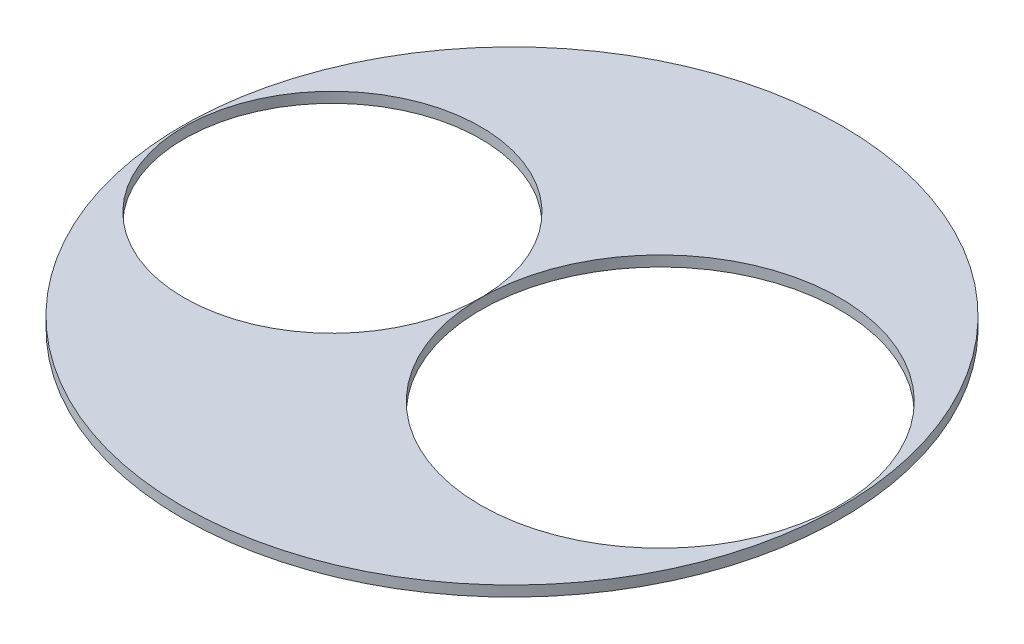
ISO-10303-21;
HEADER;
FILE_DESCRIPTION(('STEP AP214'),'2;1');
FILE_NAME('part.step','',(''),(''),'','','');
FILE_SCHEMA(('AUTOMOTIVE_DESIGN { 1 0 10303 214 1 1 1 1 }'));
ENDSEC;
DATA;
#1=APPLICATION_CONTEXT('core data for automotive mechanical design processes');
#2=APPLICATION_PROTOCOL_DEFINITION('international standard','automotive_design',2000,#1);
#3=PRODUCT_CONTEXT('',#1,'mechanical');
#4=PRODUCT('Part','Part','',(#3));
#5=PRODUCT_RELATED_PRODUCT_CATEGORY('part','',(#4));
#6=PRODUCT_DEFINITION_FORMATION('','',#4);
#7=PRODUCT_DEFINITION_CONTEXT('part definition',#1,'design');
#8=PRODUCT_DEFINITION('design','',#6,#7);
#9=PRODUCT_DEFINITION_SHAPE('','',#8);
#10=(LENGTH_UNIT() NAMED_UNIT(*) SI_UNIT(.MILLI.,.METRE.));
#11=(NAMED_UNIT(*) PLANE_ANGLE_UNIT() SI_UNIT($,.RADIAN.));
#12=(NAMED_UNIT(*) SI_UNIT($,.STERADIAN.) SOLID_ANGLE_UNIT());
#13=UNCERTAINTY_MEASURE_WITH_UNIT(LENGTH_MEASURE(1.E-05),#10,'distance_accuracy_value','');
#14=(GEOMETRIC_REPRESENTATION_CONTEXT(3) GLOBAL_UNCERTAINTY_ASSIGNED_CONTEXT((#13)) GLOBAL_UNIT_ASSIGNED_CONTEXT((#10,
#11,#12)) REPRESENTATION_CONTEXT('',''));
#15=CARTESIAN_POINT('',(0.,0.,0.));
#16=DIRECTION('',(0.,0.,1.));
#17=DIRECTION('',(1.,0.,0.));
#18=AXIS2_PLACEMENT_3D('',#15,#16,#17);
#19=CARTESIAN_POINT('',(0.,38.1,0.));
#20=DIRECTION('',(0.,1.,0.));
#21=DIRECTION('',(0.,0.,1.));
#22=AXIS2_PLACEMENT_3D('',#19,#20,#21);
#23=PLANE('',#22);
#24=CARTESIAN_POINT('',(539.876006558964,38.1,0.));
#25=DIRECTION('',(0.,1.,0.));
#26=DIRECTION('',(0.,0.,1.));
#27=AXIS2_PLACEMENT_3D('',#24,#25,#26);
#28=CIRCLE('',#27,654.05);
#29=CARTESIAN_POINT('',(539.876006558964,38.1,654.05));
#30=VERTEX_POINT('',#29);
#31=EDGE_CURVE('E48',#30,#30,#28,.T.);
#32=ORIENTED_EDGE('',*,*,#31,.F.);
#33=EDGE_LOOP('',(#32));
#34=FACE_BOUND('',#33,.T.);
#35=CARTESIAN_POINT('',(0.,38.1,0.));
#36=DIRECTION('',(0.,1.,0.));
#37=DIRECTION('',(0.,0.,1.));
#38=AXIS2_PLACEMENT_3D('',#35,#36,#37);
#39=CIRCLE('',#38,1200.);
#40=CARTESIAN_POINT('',(0.,38.1,1200.));
#41=VERTEX_POINT('',#40);
#42=EDGE_CURVE('E10',#41,#41,#39,.T.);
#43=ORIENTED_EDGE('',*,*,#42,.T.);
#44=EDGE_LOOP('',(#43));
#45=FACE_BOUND('',#44,.T.);
#46=CARTESIAN_POINT('',(-653.949393441036,38.1,0.));
#47=DIRECTION('',(0.,1.,0.));
#48=DIRECTION('',(0.,0.,1.));
#49=AXIS2_PLACEMENT_3D('',#46,#47,#48);
#50=CIRCLE('',#49,539.75);
#51=CARTESIAN_POINT('',(-653.949393441036,38.1,539.75));
#52=VERTEX_POINT('',#51);
#53=EDGE_CURVE('E53',#52,#52,#50,.T.);
#54=ORIENTED_EDGE('',*,*,#53,.F.);
#55=EDGE_LOOP('',(#54));
#56=FACE_BOUND('',#55,.T.);
#57=ADVANCED_FACE('F37',(#34,#45,#56),#23,.T.);
#58=CARTESIAN_POINT('',(0.,0.,0.));
#59=DIRECTION('',(0.,1.,0.));
#60=DIRECTION('',(0.,0.,1.));
#61=AXIS2_PLACEMENT_3D('',#58,#59,#60);
#62=PLANE('',#61);
#63=CARTESIAN_POINT('',(0.,0.,0.));
#64=DIRECTION('',(0.,1.,0.));
#65=DIRECTION('',(0.,0.,1.));
#66=AXIS2_PLACEMENT_3D('',#63,#64,#65);
#67=CIRCLE('',#66,1200.);
#68=CARTESIAN_POINT('',(0.,0.,1200.));
#69=VERTEX_POINT('',#68);
#70=EDGE_CURVE('E41',#69,#69,#67,.T.);
#71=ORIENTED_EDGE('',*,*,#70,.F.);
#72=EDGE_LOOP('',(#71));
#73=FACE_BOUND('',#72,.T.);
#74=CARTESIAN_POINT('',(539.876006558964,0.,0.));
#75=DIRECTION('',(0.,1.,0.));
#76=DIRECTION('',(0.,0.,1.));
#77=AXIS2_PLACEMENT_3D('',#74,#75,#76);
#78=CIRCLE('',#77,654.05);
#79=CARTESIAN_POINT('',(539.876006558964,0.,654.05));
#80=VERTEX_POINT('',#79);
#81=EDGE_CURVE('E50',#80,#80,#78,.T.);
#82=ORIENTED_EDGE('',*,*,#81,.T.);
#83=EDGE_LOOP('',(#82));
#84=FACE_BOUND('',#83,.T.);
#85=CARTESIAN_POINT('',(-653.949393441036,0.,0.));
#86=DIRECTION('',(0.,1.,0.));
#87=DIRECTION('',(0.,0.,1.));
#88=AXIS2_PLACEMENT_3D('',#85,#86,#87);
#89=CIRCLE('',#88,539.75);
#90=CARTESIAN_POINT('',(-653.949393441036,0.,539.75));
#91=VERTEX_POINT('',#90);
#92=EDGE_CURVE('E56',#91,#91,#89,.T.);
#93=ORIENTED_EDGE('',*,*,#92,.T.);
#94=EDGE_LOOP('',(#93));
#95=FACE_BOUND('',#94,.T.);
#96=ADVANCED_FACE('F66',(#73,#84,#95),#62,.F.);
#97=CARTESIAN_POINT('',(0.,38.1,0.));
#98=DIRECTION('',(0.,-1.,0.));
#99=DIRECTION('',(0.,0.,-1.));
#100=AXIS2_PLACEMENT_3D('',#97,#98,#99);
#101=CYLINDRICAL_SURFACE('',#100,1200.);
#102=ORIENTED_EDGE('',*,*,#42,.F.);
#103=EDGE_LOOP('',(#102));
#104=FACE_BOUND('',#103,.T.);
#105=ORIENTED_EDGE('',*,*,#70,.T.);
#106=EDGE_LOOP('',(#105));
#107=FACE_BOUND('',#106,.T.);
#108=ADVANCED_FACE('F39',(#104,#107),#101,.T.);
#109=CARTESIAN_POINT('',(539.876006558964,38.1,0.));
#110=DIRECTION('',(0.,-1.,0.));
#111=DIRECTION('',(0.,0.,-1.));
#112=AXIS2_PLACEMENT_3D('',#109,#110,#111);
#113=CYLINDRICAL_SURFACE('',#112,654.05);
#114=ORIENTED_EDGE('',*,*,#31,.T.);
#115=EDGE_LOOP('',(#114));
#116=FACE_BOUND('',#115,.T.);
#117=ORIENTED_EDGE('',*,*,#81,.F.);
#118=EDGE_LOOP('',(#117));
#119=FACE_BOUND('',#118,.T.);
#120=ADVANCED_FACE('F75',(#116,#119),#113,.F.);
#121=CARTESIAN_POINT('',(-653.949393441036,38.1,0.));
#122=DIRECTION('',(0.,-1.,0.));
#123=DIRECTION('',(0.,0.,-1.));
#124=AXIS2_PLACEMENT_3D('',#121,#122,#123);
#125=CYLINDRICAL_SURFACE('',#124,539.75);
#126=ORIENTED_EDGE('',*,*,#53,.T.);
#127=EDGE_LOOP('',(#126));
#128=FACE_BOUND('',#127,.T.);
#129=ORIENTED_EDGE('',*,*,#92,.F.);
#130=EDGE_LOOP('',(#129));
#131=FACE_BOUND('',#130,.T.);
#132=ADVANCED_FACE('F62',(#128,#131),#125,.F.);
#133=CLOSED_SHELL('',(#57,#96,#108,#120,#132));
#134=MANIFOLD_SOLID_BREP('B2',#133);
#135=ADVANCED_BREP_SHAPE_REPRESENTATION('',(#18,#134),#14);
#136=SHAPE_DEFINITION_REPRESENTATION(#9,#135);
ENDSEC;
END-ISO-10303-21;
